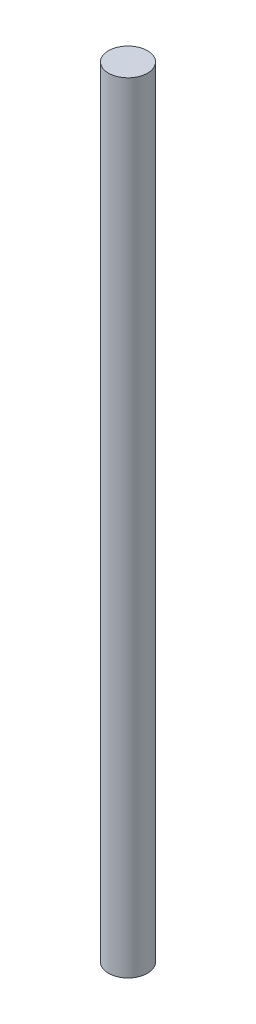
ISO-10303-21;
HEADER;
FILE_DESCRIPTION(('STEP AP214'),'2;1');
FILE_NAME('part.step','',(''),(''),'','','');
FILE_SCHEMA(('AUTOMOTIVE_DESIGN { 1 0 10303 214 1 1 1 1 }'));
ENDSEC;
DATA;
#1=APPLICATION_CONTEXT('core data for automotive mechanical design processes');
#2=APPLICATION_PROTOCOL_DEFINITION('international standard','automotive_design',2000,#1);
#3=PRODUCT_CONTEXT('',#1,'mechanical');
#4=PRODUCT('Part','Part','',(#3));
#5=PRODUCT_RELATED_PRODUCT_CATEGORY('part','',(#4));
#6=PRODUCT_DEFINITION_FORMATION('','',#4);
#7=PRODUCT_DEFINITION_CONTEXT('part definition',#1,'design');
#8=PRODUCT_DEFINITION('design','',#6,#7);
#9=PRODUCT_DEFINITION_SHAPE('','',#8);
#10=(LENGTH_UNIT() NAMED_UNIT(*) SI_UNIT(.MILLI.,.METRE.));
#11=(NAMED_UNIT(*) PLANE_ANGLE_UNIT() SI_UNIT($,.RADIAN.));
#12=(NAMED_UNIT(*) SI_UNIT($,.STERADIAN.) SOLID_ANGLE_UNIT());
#13=UNCERTAINTY_MEASURE_WITH_UNIT(LENGTH_MEASURE(1.E-05),#10,'distance_accuracy_value','');
#14=(GEOMETRIC_REPRESENTATION_CONTEXT(3) GLOBAL_UNCERTAINTY_ASSIGNED_CONTEXT((#13)) GLOBAL_UNIT_ASSIGNED_CONTEXT((#10,
#11,#12)) REPRESENTATION_CONTEXT('',''));
#15=CARTESIAN_POINT('',(0.,0.,0.));
#16=DIRECTION('',(0.,0.,1.));
#17=DIRECTION('',(1.,0.,0.));
#18=AXIS2_PLACEMENT_3D('',#15,#16,#17);
#19=CARTESIAN_POINT('',(0.,300.,0.));
#20=DIRECTION('',(0.,-1.,0.));
#21=DIRECTION('',(0.,0.,-1.));
#22=AXIS2_PLACEMENT_3D('',#19,#20,#21);
#23=CYLINDRICAL_SURFACE('',#22,7.5);
#24=CARTESIAN_POINT('',(0.,300.,0.));
#25=DIRECTION('',(0.,1.,0.));
#26=DIRECTION('',(0.,0.,1.));
#27=AXIS2_PLACEMENT_3D('',#24,#25,#26);
#28=CIRCLE('',#27,7.5);
#29=CARTESIAN_POINT('',(0.,300.,7.5));
#30=VERTEX_POINT('',#29);
#31=EDGE_CURVE('E10',#30,#30,#28,.T.);
#32=ORIENTED_EDGE('',*,*,#31,.F.);
#33=EDGE_LOOP('',(#32));
#34=FACE_BOUND('',#33,.T.);
#35=CARTESIAN_POINT('',(0.,0.,0.));
#36=DIRECTION('',(0.,1.,0.));
#37=DIRECTION('',(0.,0.,1.));
#38=AXIS2_PLACEMENT_3D('',#35,#36,#37);
#39=CIRCLE('',#38,7.5);
#40=CARTESIAN_POINT('',(0.,0.,7.5));
#41=VERTEX_POINT('',#40);
#42=EDGE_CURVE('E40',#41,#41,#39,.T.);
#43=ORIENTED_EDGE('',*,*,#42,.T.);
#44=EDGE_LOOP('',(#43));
#45=FACE_BOUND('',#44,.T.);
#46=ADVANCED_FACE('F37',(#34,#45),#23,.T.);
#47=CARTESIAN_POINT('',(0.,300.,0.));
#48=DIRECTION('',(0.,1.,0.));
#49=DIRECTION('',(0.,0.,1.));
#50=AXIS2_PLACEMENT_3D('',#47,#48,#49);
#51=PLANE('',#50);
#52=ORIENTED_EDGE('',*,*,#31,.T.);
#53=EDGE_LOOP('',(#52));
#54=FACE_BOUND('',#53,.T.);
#55=ADVANCED_FACE('F54',(#54),#51,.T.);
#56=CARTESIAN_POINT('',(0.,0.,0.));
#57=DIRECTION('',(0.,1.,0.));
#58=DIRECTION('',(0.,0.,1.));
#59=AXIS2_PLACEMENT_3D('',#56,#57,#58);
#60=PLANE('',#59);
#61=ORIENTED_EDGE('',*,*,#42,.F.);
#62=EDGE_LOOP('',(#61));
#63=FACE_BOUND('',#62,.T.);
#64=ADVANCED_FACE('F52',(#63),#60,.F.);
#65=CLOSED_SHELL('',(#46,#55,#64));
#66=MANIFOLD_SOLID_BREP('B2',#65);
#67=ADVANCED_BREP_SHAPE_REPRESENTATION('',(#18,#66),#14);
#68=SHAPE_DEFINITION_REPRESENTATION(#9,#67);
ENDSEC;
END-ISO-10303-21;
